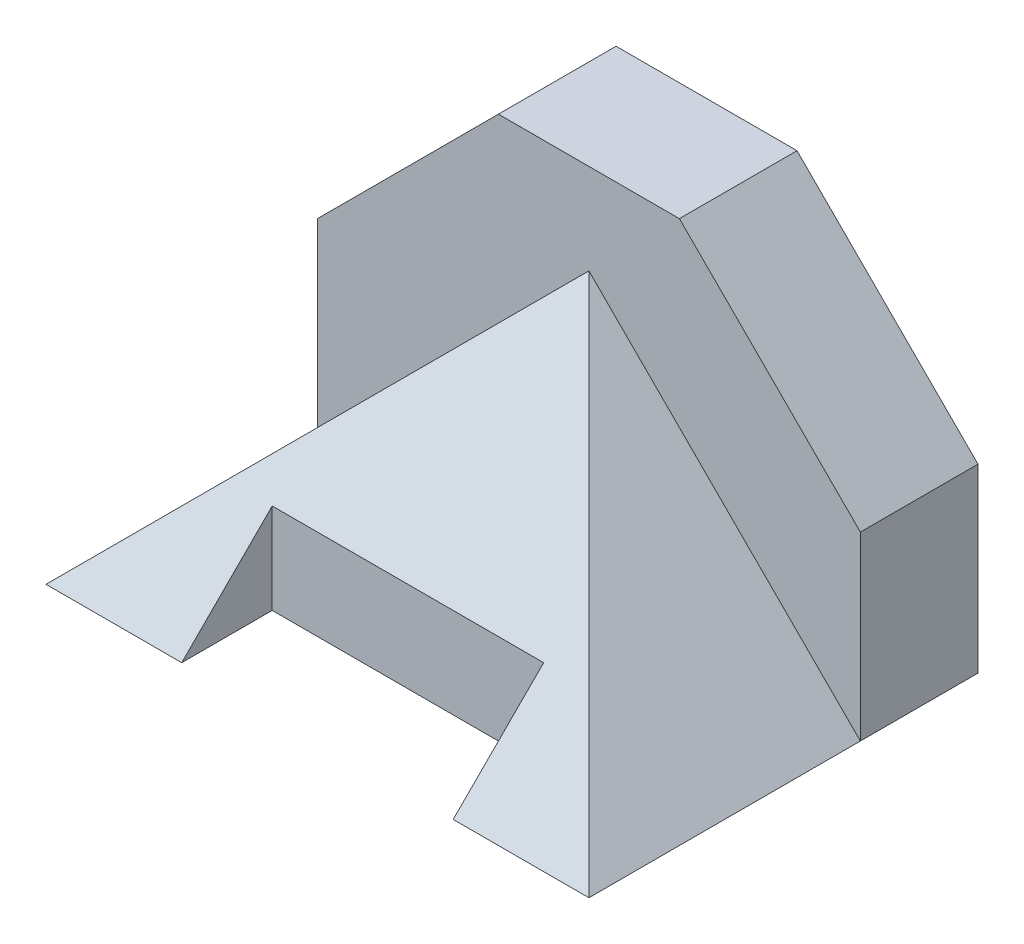
ISO-10303-21;
HEADER;
FILE_DESCRIPTION(('STEP AP214'),'2;1');
FILE_NAME('part.step','',(''),(''),'','','');
FILE_SCHEMA(('AUTOMOTIVE_DESIGN { 1 0 10303 214 1 1 1 1 }'));
ENDSEC;
DATA;
#1=APPLICATION_CONTEXT('core data for automotive mechanical design processes');
#2=APPLICATION_PROTOCOL_DEFINITION('international standard','automotive_design',2000,#1);
#3=PRODUCT_CONTEXT('',#1,'mechanical');
#4=PRODUCT('Part','Part','',(#3));
#5=PRODUCT_RELATED_PRODUCT_CATEGORY('part','',(#4));
#6=PRODUCT_DEFINITION_FORMATION('','',#4);
#7=PRODUCT_DEFINITION_CONTEXT('part definition',#1,'design');
#8=PRODUCT_DEFINITION('design','',#6,#7);
#9=PRODUCT_DEFINITION_SHAPE('','',#8);
#10=(LENGTH_UNIT() NAMED_UNIT(*) SI_UNIT(.MILLI.,.METRE.));
#11=(NAMED_UNIT(*) PLANE_ANGLE_UNIT() SI_UNIT($,.RADIAN.));
#12=(NAMED_UNIT(*) SI_UNIT($,.STERADIAN.) SOLID_ANGLE_UNIT());
#13=UNCERTAINTY_MEASURE_WITH_UNIT(LENGTH_MEASURE(1.E-05),#10,'distance_accuracy_value','');
#14=(GEOMETRIC_REPRESENTATION_CONTEXT(3) GLOBAL_UNCERTAINTY_ASSIGNED_CONTEXT((#13)) GLOBAL_UNIT_ASSIGNED_CONTEXT((#10,
#11,#12)) REPRESENTATION_CONTEXT('',''));
#15=CARTESIAN_POINT('',(0.,0.,0.));
#16=DIRECTION('',(0.,0.,1.));
#17=DIRECTION('',(1.,0.,0.));
#18=AXIS2_PLACEMENT_3D('',#15,#16,#17);
#19=CARTESIAN_POINT('',(-38.1,76.2000000000003,50.8));
#20=DIRECTION('',(0.,0.,-1.));
#21=DIRECTION('',(-1.,0.,0.));
#22=AXIS2_PLACEMENT_3D('',#19,#20,#21);
#23=PLANE('',#22);
#24=DIRECTION('',(0.,-1.,0.));
#25=VECTOR('',#24,1.);
#26=CARTESIAN_POINT('',(38.1,76.2000000000003,50.8));
#27=LINE('',#26,#25);
#28=CARTESIAN_POINT('',(38.1,25.4000000000001,50.8));
#29=VERTEX_POINT('',#28);
#30=CARTESIAN_POINT('',(38.1,0.,50.8));
#31=VERTEX_POINT('',#30);
#32=EDGE_CURVE('E180',#29,#31,#27,.T.);
#33=ORIENTED_EDGE('',*,*,#32,.F.);
#34=DIRECTION('',(-1.,0.,0.));
#35=VECTOR('',#34,1.);
#36=CARTESIAN_POINT('',(-38.1,25.4000000000001,50.8));
#37=LINE('',#36,#35);
#38=CARTESIAN_POINT('',(-38.1,25.4000000000001,50.8));
#39=VERTEX_POINT('',#38);
#40=EDGE_CURVE('E226',#29,#39,#37,.T.);
#41=ORIENTED_EDGE('',*,*,#40,.T.);
#42=DIRECTION('',(0.,-1.,0.));
#43=VECTOR('',#42,1.);
#44=CARTESIAN_POINT('',(-38.1,76.2000000000003,50.8));
#45=LINE('',#44,#43);
#46=CARTESIAN_POINT('',(-38.1,0.,50.8));
#47=VERTEX_POINT('',#46);
#48=EDGE_CURVE('E175',#39,#47,#45,.T.);
#49=ORIENTED_EDGE('',*,*,#48,.T.);
#50=DIRECTION('',(1.,0.,0.));
#51=VECTOR('',#50,1.);
#52=CARTESIAN_POINT('',(-38.1,0.,50.8));
#53=LINE('',#52,#51);
#54=EDGE_CURVE('E163',#47,#31,#53,.T.);
#55=ORIENTED_EDGE('',*,*,#54,.T.);
#56=EDGE_LOOP('',(#33,#41,#49,#55));
#57=FACE_BOUND('',#56,.T.);
#58=ADVANCED_FACE('F39',(#57),#23,.F.);
#59=CARTESIAN_POINT('',(-76.2,0.,-33.02));
#60=DIRECTION('',(1.,0.,0.));
#61=DIRECTION('',(0.,0.,-1.));
#62=AXIS2_PLACEMENT_3D('',#59,#60,#61);
#63=PLANE('',#62);
#64=DIRECTION('',(0.,1.,0.));
#65=VECTOR('',#64,1.);
#66=CARTESIAN_POINT('',(-76.2,0.,0.));
#67=LINE('',#66,#65);
#68=CARTESIAN_POINT('',(-76.2,0.,0.));
#69=VERTEX_POINT('',#68);
#70=CARTESIAN_POINT('',(-76.2,50.8,0.));
#71=VERTEX_POINT('',#70);
#72=EDGE_CURVE('E140',#69,#71,#67,.T.);
#73=ORIENTED_EDGE('',*,*,#72,.T.);
#74=DIRECTION('',(0.,0.,1.));
#75=VECTOR('',#74,1.);
#76=CARTESIAN_POINT('',(-76.2,50.8,-33.02));
#77=LINE('',#76,#75);
#78=CARTESIAN_POINT('',(-76.2,50.8,-33.02));
#79=VERTEX_POINT('',#78);
#80=EDGE_CURVE('E106',#79,#71,#77,.T.);
#81=ORIENTED_EDGE('',*,*,#80,.F.);
#82=DIRECTION('',(0.,1.,0.));
#83=VECTOR('',#82,1.);
#84=CARTESIAN_POINT('',(-76.2,0.,-33.02));
#85=LINE('',#84,#83);
#86=CARTESIAN_POINT('',(-76.2,0.,-33.02));
#87=VERTEX_POINT('',#86);
#88=EDGE_CURVE('E133',#87,#79,#85,.T.);
#89=ORIENTED_EDGE('',*,*,#88,.F.);
#90=DIRECTION('',(0.,0.,1.));
#91=VECTOR('',#90,1.);
#92=CARTESIAN_POINT('',(-76.2,0.,-33.02));
#93=LINE('',#92,#91);
#94=EDGE_CURVE('E135',#87,#69,#93,.T.);
#95=ORIENTED_EDGE('',*,*,#94,.T.);
#96=EDGE_LOOP('',(#73,#81,#89,#95));
#97=FACE_BOUND('',#96,.T.);
#98=ADVANCED_FACE('F41',(#97),#63,.F.);
#99=CARTESIAN_POINT('',(-38.1,76.2000000000003,76.2));
#100=DIRECTION('',(-1.,0.,0.));
#101=DIRECTION('',(0.,0.,1.));
#102=AXIS2_PLACEMENT_3D('',#99,#100,#101);
#103=PLANE('',#102);
#104=ORIENTED_EDGE('',*,*,#48,.F.);
#105=DIRECTION('',(0.,-0.707106781186549,0.707106781186546));
#106=VECTOR('',#105,1.);
#107=CARTESIAN_POINT('',(-38.1,38.1000000000003,38.0999999999999));
#108=LINE('',#107,#106);
#109=CARTESIAN_POINT('',(-38.1,0.,76.2));
#110=VERTEX_POINT('',#109);
#111=EDGE_CURVE('E229',#39,#110,#108,.T.);
#112=ORIENTED_EDGE('',*,*,#111,.T.);
#113=DIRECTION('',(0.,0.,-1.));
#114=VECTOR('',#113,1.);
#115=CARTESIAN_POINT('',(-38.1,0.,76.2));
#116=LINE('',#115,#114);
#117=EDGE_CURVE('E151',#110,#47,#116,.T.);
#118=ORIENTED_EDGE('',*,*,#117,.T.);
#119=EDGE_LOOP('',(#104,#112,#118));
#120=FACE_BOUND('',#119,.T.);
#121=ADVANCED_FACE('F243',(#120),#103,.F.);
#122=CARTESIAN_POINT('',(76.2,0.,-33.02));
#123=DIRECTION('',(1.,0.,0.));
#124=DIRECTION('',(0.,0.,-1.));
#125=AXIS2_PLACEMENT_3D('',#122,#123,#124);
#126=PLANE('',#125);
#127=DIRECTION('',(0.,0.,1.));
#128=VECTOR('',#127,1.);
#129=CARTESIAN_POINT('',(76.2,50.8,-33.02));
#130=LINE('',#129,#128);
#131=CARTESIAN_POINT('',(76.2,50.8,-33.02));
#132=VERTEX_POINT('',#131);
#133=CARTESIAN_POINT('',(76.2,50.8,0.));
#134=VERTEX_POINT('',#133);
#135=EDGE_CURVE('E146',#132,#134,#130,.T.);
#136=ORIENTED_EDGE('',*,*,#135,.T.);
#137=DIRECTION('',(0.,1.,0.));
#138=VECTOR('',#137,1.);
#139=CARTESIAN_POINT('',(76.2,0.,0.));
#140=LINE('',#139,#138);
#141=CARTESIAN_POINT('',(76.2,0.,0.));
#142=VERTEX_POINT('',#141);
#143=EDGE_CURVE('E129',#142,#134,#140,.T.);
#144=ORIENTED_EDGE('',*,*,#143,.F.);
#145=DIRECTION('',(0.,0.,1.));
#146=VECTOR('',#145,1.);
#147=CARTESIAN_POINT('',(76.2,0.,-33.02));
#148=LINE('',#147,#146);
#149=CARTESIAN_POINT('',(76.2,0.,-33.02));
#150=VERTEX_POINT('',#149);
#151=EDGE_CURVE('E152',#150,#142,#148,.T.);
#152=ORIENTED_EDGE('',*,*,#151,.F.);
#153=DIRECTION('',(0.,1.,0.));
#154=VECTOR('',#153,1.);
#155=CARTESIAN_POINT('',(76.2,0.,-33.02));
#156=LINE('',#155,#154);
#157=EDGE_CURVE('E150',#150,#132,#156,.T.);
#158=ORIENTED_EDGE('',*,*,#157,.T.);
#159=EDGE_LOOP('',(#136,#144,#152,#158));
#160=FACE_BOUND('',#159,.T.);
#161=ADVANCED_FACE('F268',(#160),#126,.T.);
#162=CARTESIAN_POINT('',(38.1,76.2000000000003,76.2));
#163=DIRECTION('',(1.,0.,0.));
#164=DIRECTION('',(0.,0.,-1.));
#165=AXIS2_PLACEMENT_3D('',#162,#163,#164);
#166=PLANE('',#165);
#167=DIRECTION('',(0.,0.,1.));
#168=VECTOR('',#167,1.);
#169=CARTESIAN_POINT('',(38.1,0.,76.2));
#170=LINE('',#169,#168);
#171=CARTESIAN_POINT('',(38.1,0.,76.2));
#172=VERTEX_POINT('',#171);
#173=EDGE_CURVE('E251',#31,#172,#170,.T.);
#174=ORIENTED_EDGE('',*,*,#173,.T.);
#175=DIRECTION('',(0.,0.707106781186549,-0.707106781186546));
#176=VECTOR('',#175,1.);
#177=CARTESIAN_POINT('',(38.1,38.1000000000003,38.0999999999999));
#178=LINE('',#177,#176);
#179=EDGE_CURVE('E241',#172,#29,#178,.T.);
#180=ORIENTED_EDGE('',*,*,#179,.T.);
#181=ORIENTED_EDGE('',*,*,#32,.T.);
#182=EDGE_LOOP('',(#174,#180,#181));
#183=FACE_BOUND('',#182,.T.);
#184=ADVANCED_FACE('F258',(#183),#166,.F.);
#185=CARTESIAN_POINT('',(0.,0.,-33.02));
#186=DIRECTION('',(0.,-1.,0.));
#187=DIRECTION('',(0.,0.,-1.));
#188=AXIS2_PLACEMENT_3D('',#185,#186,#187);
#189=PLANE('',#188);
#190=ORIENTED_EDGE('',*,*,#151,.T.);
#191=DIRECTION('',(0.,0.,-1.));
#192=VECTOR('',#191,1.);
#193=CARTESIAN_POINT('',(76.2,0.,76.201));
#194=LINE('',#193,#192);
#195=CARTESIAN_POINT('',(76.2,0.,76.2));
#196=VERTEX_POINT('',#195);
#197=EDGE_CURVE('E124',#196,#142,#194,.T.);
#198=ORIENTED_EDGE('',*,*,#197,.F.);
#199=DIRECTION('',(1.,0.,0.));
#200=VECTOR('',#199,1.);
#201=CARTESIAN_POINT('',(76.2,0.,76.2));
#202=LINE('',#201,#200);
#203=EDGE_CURVE('E157',#172,#196,#202,.T.);
#204=ORIENTED_EDGE('',*,*,#203,.F.);
#205=ORIENTED_EDGE('',*,*,#173,.F.);
#206=ORIENTED_EDGE('',*,*,#54,.F.);
#207=ORIENTED_EDGE('',*,*,#117,.F.);
#208=DIRECTION('',(1.,0.,0.));
#209=VECTOR('',#208,1.);
#210=CARTESIAN_POINT('',(-76.2,0.,76.2));
#211=LINE('',#210,#209);
#212=CARTESIAN_POINT('',(-76.2,0.,76.2));
#213=VERTEX_POINT('',#212);
#214=EDGE_CURVE('E139',#213,#110,#211,.T.);
#215=ORIENTED_EDGE('',*,*,#214,.F.);
#216=DIRECTION('',(0.,0.,-1.));
#217=VECTOR('',#216,1.);
#218=CARTESIAN_POINT('',(-76.2,0.,76.201));
#219=LINE('',#218,#217);
#220=EDGE_CURVE('E156',#213,#69,#219,.T.);
#221=ORIENTED_EDGE('',*,*,#220,.T.);
#222=ORIENTED_EDGE('',*,*,#94,.F.);
#223=DIRECTION('',(1.,0.,0.));
#224=VECTOR('',#223,1.);
#225=CARTESIAN_POINT('',(0.,0.,-33.02));
#226=LINE('',#225,#224);
#227=EDGE_CURVE('E109',#87,#150,#226,.T.);
#228=ORIENTED_EDGE('',*,*,#227,.T.);
#229=EDGE_LOOP('',(#190,#198,#204,#205,#206,#207,#215,#221,#222,#228));
#230=FACE_BOUND('',#229,.T.);
#231=ADVANCED_FACE('F209',(#230),#189,.T.);
#232=CARTESIAN_POINT('',(-63.5,63.5,-33.02));
#233=DIRECTION('',(0.707106781186548,-0.707106781186548,0.));
#234=DIRECTION('',(0.707106781186548,0.707106781186548,0.));
#235=AXIS2_PLACEMENT_3D('',#232,#233,#234);
#236=PLANE('',#235);
#237=DIRECTION('',(0.707106781186548,0.707106781186548,0.));
#238=VECTOR('',#237,1.);
#239=CARTESIAN_POINT('',(-63.5,63.5,0.));
#240=LINE('',#239,#238);
#241=CARTESIAN_POINT('',(-25.4,101.6,0.));
#242=VERTEX_POINT('',#241);
#243=EDGE_CURVE('E57',#71,#242,#240,.T.);
#244=ORIENTED_EDGE('',*,*,#243,.T.);
#245=DIRECTION('',(0.,0.,1.));
#246=VECTOR('',#245,1.);
#247=CARTESIAN_POINT('',(-25.4,101.6,-33.02));
#248=LINE('',#247,#246);
#249=CARTESIAN_POINT('',(-25.4,101.6,-33.02));
#250=VERTEX_POINT('',#249);
#251=EDGE_CURVE('E103',#250,#242,#248,.T.);
#252=ORIENTED_EDGE('',*,*,#251,.F.);
#253=DIRECTION('',(0.707106781186548,0.707106781186548,0.));
#254=VECTOR('',#253,1.);
#255=CARTESIAN_POINT('',(-63.5,63.5,-33.02));
#256=LINE('',#255,#254);
#257=EDGE_CURVE('E185',#79,#250,#256,.T.);
#258=ORIENTED_EDGE('',*,*,#257,.F.);
#259=ORIENTED_EDGE('',*,*,#80,.T.);
#260=EDGE_LOOP('',(#244,#252,#258,#259));
#261=FACE_BOUND('',#260,.T.);
#262=ADVANCED_FACE('F101',(#261),#236,.F.);
#263=CARTESIAN_POINT('',(0.,101.6,-33.02));
#264=DIRECTION('',(0.,1.,0.));
#265=DIRECTION('',(0.,0.,1.));
#266=AXIS2_PLACEMENT_3D('',#263,#264,#265);
#267=PLANE('',#266);
#268=DIRECTION('',(-1.,0.,0.));
#269=VECTOR('',#268,1.);
#270=CARTESIAN_POINT('',(0.,101.6,0.));
#271=LINE('',#270,#269);
#272=CARTESIAN_POINT('',(25.4,101.6,0.));
#273=VERTEX_POINT('',#272);
#274=EDGE_CURVE('E113',#273,#242,#271,.T.);
#275=ORIENTED_EDGE('',*,*,#274,.F.);
#276=DIRECTION('',(0.,0.,1.));
#277=VECTOR('',#276,1.);
#278=CARTESIAN_POINT('',(25.4,101.6,-33.02));
#279=LINE('',#278,#277);
#280=CARTESIAN_POINT('',(25.4,101.6,-33.02));
#281=VERTEX_POINT('',#280);
#282=EDGE_CURVE('E143',#281,#273,#279,.T.);
#283=ORIENTED_EDGE('',*,*,#282,.F.);
#284=DIRECTION('',(-1.,0.,0.));
#285=VECTOR('',#284,1.);
#286=CARTESIAN_POINT('',(0.,101.6,-33.02));
#287=LINE('',#286,#285);
#288=EDGE_CURVE('E115',#281,#250,#287,.T.);
#289=ORIENTED_EDGE('',*,*,#288,.T.);
#290=ORIENTED_EDGE('',*,*,#251,.T.);
#291=EDGE_LOOP('',(#275,#283,#289,#290));
#292=FACE_BOUND('',#291,.T.);
#293=ADVANCED_FACE('F112',(#292),#267,.T.);
#294=CARTESIAN_POINT('',(63.5,63.5,-33.02));
#295=DIRECTION('',(0.707106781186548,0.707106781186548,0.));
#296=DIRECTION('',(-0.707106781186548,0.707106781186548,0.));
#297=AXIS2_PLACEMENT_3D('',#294,#295,#296);
#298=PLANE('',#297);
#299=DIRECTION('',(-0.707106781186548,0.707106781186548,0.));
#300=VECTOR('',#299,1.);
#301=CARTESIAN_POINT('',(63.5,63.5,0.));
#302=LINE('',#301,#300);
#303=EDGE_CURVE('E121',#134,#273,#302,.T.);
#304=ORIENTED_EDGE('',*,*,#303,.F.);
#305=ORIENTED_EDGE('',*,*,#135,.F.);
#306=DIRECTION('',(-0.707106781186548,0.707106781186548,0.));
#307=VECTOR('',#306,1.);
#308=CARTESIAN_POINT('',(63.5,63.5,-33.02));
#309=LINE('',#308,#307);
#310=EDGE_CURVE('E117',#132,#281,#309,.T.);
#311=ORIENTED_EDGE('',*,*,#310,.T.);
#312=ORIENTED_EDGE('',*,*,#282,.T.);
#313=EDGE_LOOP('',(#304,#305,#311,#312));
#314=FACE_BOUND('',#313,.T.);
#315=ADVANCED_FACE('F271',(#314),#298,.T.);
#316=CARTESIAN_POINT('',(0.,0.,-33.02));
#317=DIRECTION('',(0.,0.,1.));
#318=DIRECTION('',(1.,0.,0.));
#319=AXIS2_PLACEMENT_3D('',#316,#317,#318);
#320=PLANE('',#319);
#321=ORIENTED_EDGE('',*,*,#227,.F.);
#322=ORIENTED_EDGE('',*,*,#88,.T.);
#323=ORIENTED_EDGE('',*,*,#257,.T.);
#324=ORIENTED_EDGE('',*,*,#288,.F.);
#325=ORIENTED_EDGE('',*,*,#310,.F.);
#326=ORIENTED_EDGE('',*,*,#157,.F.);
#327=EDGE_LOOP('',(#321,#322,#323,#324,#325,#326));
#328=FACE_BOUND('',#327,.T.);
#329=ADVANCED_FACE('F194',(#328),#320,.F.);
#330=CARTESIAN_POINT('',(0.,0.,0.));
#331=DIRECTION('',(0.,0.,1.));
#332=DIRECTION('',(1.,0.,0.));
#333=AXIS2_PLACEMENT_3D('',#330,#331,#332);
#334=PLANE('',#333);
#335=ORIENTED_EDGE('',*,*,#303,.T.);
#336=ORIENTED_EDGE('',*,*,#274,.T.);
#337=ORIENTED_EDGE('',*,*,#243,.F.);
#338=ORIENTED_EDGE('',*,*,#72,.F.);
#339=DIRECTION('',(0.707106781186546,0.707106781186549,0.));
#340=VECTOR('',#339,1.);
#341=CARTESIAN_POINT('',(-38.1000000000001,38.1,0.));
#342=LINE('',#341,#340);
#343=CARTESIAN_POINT('',(0.,76.2000000000003,0.));
#344=VERTEX_POINT('',#343);
#345=EDGE_CURVE('E49',#69,#344,#342,.T.);
#346=ORIENTED_EDGE('',*,*,#345,.T.);
#347=DIRECTION('',(0.707106781186546,-0.707106781186549,0.));
#348=VECTOR('',#347,1.);
#349=CARTESIAN_POINT('',(38.1000000000001,38.1,0.));
#350=LINE('',#349,#348);
#351=EDGE_CURVE('E187',#344,#142,#350,.T.);
#352=ORIENTED_EDGE('',*,*,#351,.T.);
#353=ORIENTED_EDGE('',*,*,#143,.T.);
#354=EDGE_LOOP('',(#335,#336,#337,#338,#346,#352,#353));
#355=FACE_BOUND('',#354,.T.);
#356=ADVANCED_FACE('F119',(#355),#334,.T.);
#357=CARTESIAN_POINT('',(38.1000000000001,38.1,76.201));
#358=DIRECTION('',(0.707106781186549,0.707106781186546,0.));
#359=DIRECTION('',(-0.707106781186546,0.707106781186549,0.));
#360=AXIS2_PLACEMENT_3D('',#357,#358,#359);
#361=PLANE('',#360);
#362=DIRECTION('',(-0.577350269189625,0.577350269189627,-0.577350269189625));
#363=VECTOR('',#362,1.);
#364=CARTESIAN_POINT('',(50.8003333333334,25.3996666666667,50.8003333333334));
#365=LINE('',#364,#363);
#366=EDGE_CURVE('E206',#196,#344,#365,.T.);
#367=ORIENTED_EDGE('',*,*,#366,.F.);
#368=ORIENTED_EDGE('',*,*,#197,.T.);
#369=ORIENTED_EDGE('',*,*,#351,.F.);
#370=EDGE_LOOP('',(#367,#368,#369));
#371=FACE_BOUND('',#370,.T.);
#372=ADVANCED_FACE('F204',(#371),#361,.T.);
#373=CARTESIAN_POINT('',(-38.1000000000001,38.1,76.201));
#374=DIRECTION('',(-0.707106781186549,0.707106781186546,0.));
#375=DIRECTION('',(-0.707106781186546,-0.707106781186549,0.));
#376=AXIS2_PLACEMENT_3D('',#373,#374,#375);
#377=PLANE('',#376);
#378=DIRECTION('',(-0.577350269189625,-0.577350269189627,0.577350269189625));
#379=VECTOR('',#378,1.);
#380=CARTESIAN_POINT('',(-50.8003333333334,25.3996666666667,50.8003333333334));
#381=LINE('',#380,#379);
#382=EDGE_CURVE('E11',#344,#213,#381,.T.);
#383=ORIENTED_EDGE('',*,*,#382,.F.);
#384=ORIENTED_EDGE('',*,*,#345,.F.);
#385=ORIENTED_EDGE('',*,*,#220,.F.);
#386=EDGE_LOOP('',(#383,#384,#385));
#387=FACE_BOUND('',#386,.T.);
#388=ADVANCED_FACE('F300',(#387),#377,.T.);
#389=CARTESIAN_POINT('',(-76.2,0.,76.2));
#390=DIRECTION('',(0.,-0.707106781186546,-0.707106781186549));
#391=DIRECTION('',(0.,0.707106781186549,-0.707106781186546));
#392=AXIS2_PLACEMENT_3D('',#389,#390,#391);
#393=PLANE('',#392);
#394=ORIENTED_EDGE('',*,*,#40,.F.);
#395=ORIENTED_EDGE('',*,*,#179,.F.);
#396=ORIENTED_EDGE('',*,*,#203,.T.);
#397=ORIENTED_EDGE('',*,*,#366,.T.);
#398=ORIENTED_EDGE('',*,*,#382,.T.);
#399=ORIENTED_EDGE('',*,*,#214,.T.);
#400=ORIENTED_EDGE('',*,*,#111,.F.);
#401=EDGE_LOOP('',(#394,#395,#396,#397,#398,#399,#400));
#402=FACE_BOUND('',#401,.T.);
#403=ADVANCED_FACE('F230',(#402),#393,.F.);
#404=CLOSED_SHELL('',(#58,#98,#121,#161,#184,#231,#262,#293,#315,#329,#356,#372,#388,#403));
#405=MANIFOLD_SOLID_BREP('B2',#404);
#406=ADVANCED_BREP_SHAPE_REPRESENTATION('',(#18,#405),#14);
#407=SHAPE_DEFINITION_REPRESENTATION(#9,#406);
ENDSEC;
END-ISO-10303-21;
